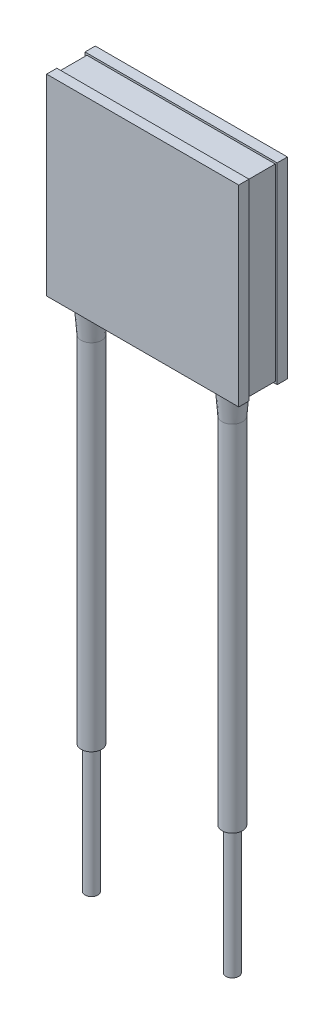
ISO-10303-21;
HEADER;
FILE_DESCRIPTION(('STEP AP214'),'2;1');
FILE_NAME('part.step','',(''),(''),'','','');
FILE_SCHEMA(('AUTOMOTIVE_DESIGN { 1 0 10303 214 1 1 1 1 }'));
ENDSEC;
DATA;
#1=APPLICATION_CONTEXT('core data for automotive mechanical design processes');
#2=APPLICATION_PROTOCOL_DEFINITION('international standard','automotive_design',2000,#1);
#3=PRODUCT_CONTEXT('',#1,'mechanical');
#4=PRODUCT('Part','Part','',(#3));
#5=PRODUCT_RELATED_PRODUCT_CATEGORY('part','',(#4));
#6=PRODUCT_DEFINITION_FORMATION('','',#4);
#7=PRODUCT_DEFINITION_CONTEXT('part definition',#1,'design');
#8=PRODUCT_DEFINITION('design','',#6,#7);
#9=PRODUCT_DEFINITION_SHAPE('','',#8);
#10=(LENGTH_UNIT() NAMED_UNIT(*) SI_UNIT(.MILLI.,.METRE.));
#11=(NAMED_UNIT(*) PLANE_ANGLE_UNIT() SI_UNIT($,.RADIAN.));
#12=(NAMED_UNIT(*) SI_UNIT($,.STERADIAN.) SOLID_ANGLE_UNIT());
#13=UNCERTAINTY_MEASURE_WITH_UNIT(LENGTH_MEASURE(1.E-05),#10,'distance_accuracy_value','');
#14=(GEOMETRIC_REPRESENTATION_CONTEXT(3) GLOBAL_UNCERTAINTY_ASSIGNED_CONTEXT((#13)) GLOBAL_UNIT_ASSIGNED_CONTEXT((#10,
#11,#12)) REPRESENTATION_CONTEXT('',''));
#15=CARTESIAN_POINT('',(0.,0.,0.));
#16=DIRECTION('',(0.,0.,1.));
#17=DIRECTION('',(1.,0.,0.));
#18=AXIS2_PLACEMENT_3D('',#15,#16,#17);
#19=CARTESIAN_POINT('',(5.5,-7.35,2.3));
#20=DIRECTION('',(0.,1.,0.));
#21=DIRECTION('',(1.,0.,0.));
#22=AXIS2_PLACEMENT_3D('',#19,#20,#21);
#23=CYLINDRICAL_SURFACE('',#22,0.5);
#24=CARTESIAN_POINT('',(5.5,-37.5,2.3));
#25=DIRECTION('',(0.,-1.,0.));
#26=DIRECTION('',(1.,0.,0.));
#27=AXIS2_PLACEMENT_3D('',#24,#25,#26);
#28=CIRCLE('',#27,0.5);
#29=CARTESIAN_POINT('',(6.,-37.5,2.3));
#30=VERTEX_POINT('',#29);
#31=EDGE_CURVE('E11',#30,#30,#28,.T.);
#32=ORIENTED_EDGE('',*,*,#31,.T.);
#33=EDGE_LOOP('',(#32));
#34=FACE_BOUND('',#33,.T.);
#35=CARTESIAN_POINT('',(5.5,-47.5,2.3));
#36=DIRECTION('',(0.,-1.,0.));
#37=DIRECTION('',(1.,0.,0.));
#38=AXIS2_PLACEMENT_3D('',#35,#36,#37);
#39=CIRCLE('',#38,0.5);
#40=CARTESIAN_POINT('',(6.,-47.5,2.3));
#41=VERTEX_POINT('',#40);
#42=EDGE_CURVE('E301',#41,#41,#39,.T.);
#43=ORIENTED_EDGE('',*,*,#42,.F.);
#44=EDGE_LOOP('',(#43));
#45=FACE_BOUND('',#44,.T.);
#46=ADVANCED_FACE('F16',(#34,#45),#23,.T.);
#47=CARTESIAN_POINT('',(5.5,-7.35,2.3));
#48=DIRECTION('',(0.,1.,0.));
#49=DIRECTION('',(1.,0.,0.));
#50=AXIS2_PLACEMENT_3D('',#47,#48,#49);
#51=CYLINDRICAL_SURFACE('',#50,0.8);
#52=CARTESIAN_POINT('',(5.5,-9.85,2.3));
#53=DIRECTION('',(0.,-1.,0.));
#54=DIRECTION('',(1.,0.,0.));
#55=AXIS2_PLACEMENT_3D('',#52,#53,#54);
#56=CIRCLE('',#55,0.8);
#57=CARTESIAN_POINT('',(6.3,-9.85,2.3));
#58=VERTEX_POINT('',#57);
#59=EDGE_CURVE('E26',#58,#58,#56,.T.);
#60=ORIENTED_EDGE('',*,*,#59,.T.);
#61=EDGE_LOOP('',(#60));
#62=FACE_BOUND('',#61,.T.);
#63=CARTESIAN_POINT('',(5.5,-37.5,2.3));
#64=DIRECTION('',(0.,-1.,0.));
#65=DIRECTION('',(1.,0.,0.));
#66=AXIS2_PLACEMENT_3D('',#63,#64,#65);
#67=CIRCLE('',#66,0.799999999999999);
#68=CARTESIAN_POINT('',(6.3,-37.5,2.3));
#69=VERTEX_POINT('',#68);
#70=EDGE_CURVE('E263',#69,#69,#67,.T.);
#71=ORIENTED_EDGE('',*,*,#70,.F.);
#72=EDGE_LOOP('',(#71));
#73=FACE_BOUND('',#72,.T.);
#74=ADVANCED_FACE('F308',(#62,#73),#51,.T.);
#75=CARTESIAN_POINT('',(5.5,-9.85,2.3));
#76=DIRECTION('',(0.,1.,0.));
#77=DIRECTION('',(1.,0.,0.));
#78=AXIS2_PLACEMENT_3D('',#75,#76,#77);
#79=CONICAL_SURFACE('',#78,0.8,0.0798299857122372);
#80=CARTESIAN_POINT('',(5.5,-7.35,2.3));
#81=DIRECTION('',(0.,-1.,0.));
#82=DIRECTION('',(0.,0.,1.));
#83=AXIS2_PLACEMENT_3D('',#80,#81,#82);
#84=CIRCLE('',#83,1.);
#85=CARTESIAN_POINT('',(4.78585715714572,-7.35,3.));
#86=VERTEX_POINT('',#85);
#87=CARTESIAN_POINT('',(6.21414284285429,-7.35,3.));
#88=VERTEX_POINT('',#87);
#89=EDGE_CURVE('E296',#86,#88,#84,.T.);
#90=ORIENTED_EDGE('',*,*,#89,.T.);
#91=CARTESIAN_POINT('',(6.21414284285429,-7.35,3.));
#92=CARTESIAN_POINT('',(6.20854131452161,-7.40000364209781,3.));
#93=CARTESIAN_POINT('',(6.20290787818541,-7.45000402656601,3.));
#94=CARTESIAN_POINT('',(6.19724027422403,-7.5,3.));
#95=B_SPLINE_CURVE_WITH_KNOTS('',3,(#91,#92,#93,#94),.UNSPECIFIED.,.F.,.F.,(4,4),
(0.00177126621246472,0.00192221302484469),.UNSPECIFIED.);
#96=CARTESIAN_POINT('',(6.19724027422403,-7.5,3.));
#97=VERTEX_POINT('',#96);
#98=EDGE_CURVE('E204',#88,#97,#95,.T.);
#99=ORIENTED_EDGE('',*,*,#98,.T.);
#100=CARTESIAN_POINT('',(5.5,-7.5,2.3));
#101=DIRECTION('',(0.,-1.,0.));
#102=DIRECTION('',(0.,0.,1.));
#103=AXIS2_PLACEMENT_3D('',#100,#101,#102);
#104=CIRCLE('',#103,0.988);
#105=CARTESIAN_POINT('',(4.80275972577597,-7.5,3.));
#106=VERTEX_POINT('',#105);
#107=EDGE_CURVE('E201',#97,#106,#104,.T.);
#108=ORIENTED_EDGE('',*,*,#107,.T.);
#109=CARTESIAN_POINT('',(4.80275972577597,-7.5,3.));
#110=CARTESIAN_POINT('',(4.79709209099586,-7.4500037547028,3.));
#111=CARTESIAN_POINT('',(4.79145867453783,-7.40000354443376,3.));
#112=CARTESIAN_POINT('',(4.78585715714572,-7.35,3.));
#113=B_SPLINE_CURVE_WITH_KNOTS('',3,(#109,#110,#111,#112),.UNSPECIFIED.,.F.,.F.,(4,4),
(0.00176171988814777,0.00191266054009144),.UNSPECIFIED.);
#114=EDGE_CURVE('E205',#106,#86,#113,.T.);
#115=ORIENTED_EDGE('',*,*,#114,.T.);
#116=EDGE_LOOP('',(#90,#99,#108,#115));
#117=FACE_BOUND('',#116,.T.);
#118=ORIENTED_EDGE('',*,*,#59,.F.);
#119=EDGE_LOOP('',(#118));
#120=FACE_BOUND('',#119,.T.);
#121=ADVANCED_FACE('F315',(#117,#120),#79,.T.);
#122=CARTESIAN_POINT('',(-5.5,-7.35,2.3));
#123=DIRECTION('',(0.,1.,0.));
#124=DIRECTION('',(-1.,0.,0.));
#125=AXIS2_PLACEMENT_3D('',#122,#123,#124);
#126=CYLINDRICAL_SURFACE('',#125,0.5);
#127=CARTESIAN_POINT('',(-5.5,-37.5,2.3));
#128=DIRECTION('',(0.,1.,0.));
#129=DIRECTION('',(-1.,0.,0.));
#130=AXIS2_PLACEMENT_3D('',#127,#128,#129);
#131=CIRCLE('',#130,0.5);
#132=CARTESIAN_POINT('',(-6.,-37.5,2.3));
#133=VERTEX_POINT('',#132);
#134=EDGE_CURVE('E251',#133,#133,#131,.T.);
#135=ORIENTED_EDGE('',*,*,#134,.F.);
#136=EDGE_LOOP('',(#135));
#137=FACE_BOUND('',#136,.T.);
#138=CARTESIAN_POINT('',(-5.5,-47.5,2.3));
#139=DIRECTION('',(0.,1.,0.));
#140=DIRECTION('',(-1.,0.,0.));
#141=AXIS2_PLACEMENT_3D('',#138,#139,#140);
#142=CIRCLE('',#141,0.5);
#143=CARTESIAN_POINT('',(-6.,-47.5,2.3));
#144=VERTEX_POINT('',#143);
#145=EDGE_CURVE('E291',#144,#144,#142,.T.);
#146=ORIENTED_EDGE('',*,*,#145,.T.);
#147=EDGE_LOOP('',(#146));
#148=FACE_BOUND('',#147,.T.);
#149=ADVANCED_FACE('F321',(#137,#148),#126,.T.);
#150=CARTESIAN_POINT('',(-5.5,-7.35,2.3));
#151=DIRECTION('',(0.,1.,0.));
#152=DIRECTION('',(-1.,0.,0.));
#153=AXIS2_PLACEMENT_3D('',#150,#151,#152);
#154=CYLINDRICAL_SURFACE('',#153,0.8);
#155=CARTESIAN_POINT('',(-5.5,-9.85,2.3));
#156=DIRECTION('',(0.,1.,0.));
#157=DIRECTION('',(-1.,0.,0.));
#158=AXIS2_PLACEMENT_3D('',#155,#156,#157);
#159=CIRCLE('',#158,0.8);
#160=CARTESIAN_POINT('',(-6.3,-9.85,2.3));
#161=VERTEX_POINT('',#160);
#162=EDGE_CURVE('E285',#161,#161,#159,.T.);
#163=ORIENTED_EDGE('',*,*,#162,.F.);
#164=EDGE_LOOP('',(#163));
#165=FACE_BOUND('',#164,.T.);
#166=CARTESIAN_POINT('',(-5.5,-37.5,2.3));
#167=DIRECTION('',(0.,1.,0.));
#168=DIRECTION('',(-1.,0.,0.));
#169=AXIS2_PLACEMENT_3D('',#166,#167,#168);
#170=CIRCLE('',#169,0.799999999999999);
#171=CARTESIAN_POINT('',(-6.3,-37.5,2.3));
#172=VERTEX_POINT('',#171);
#173=EDGE_CURVE('E288',#172,#172,#170,.T.);
#174=ORIENTED_EDGE('',*,*,#173,.T.);
#175=EDGE_LOOP('',(#174));
#176=FACE_BOUND('',#175,.T.);
#177=ADVANCED_FACE('F325',(#165,#176),#154,.T.);
#178=CARTESIAN_POINT('',(-5.5,-9.85,2.3));
#179=DIRECTION('',(0.,1.,0.));
#180=DIRECTION('',(-1.,0.,0.));
#181=AXIS2_PLACEMENT_3D('',#178,#179,#180);
#182=CONICAL_SURFACE('',#181,0.8,0.0798299857122372);
#183=CARTESIAN_POINT('',(-6.19724027422403,-7.5,3.));
#184=CARTESIAN_POINT('',(-6.20290790900415,-7.4500037547028,3.));
#185=CARTESIAN_POINT('',(-6.20854132546217,-7.40000354443376,3.));
#186=CARTESIAN_POINT('',(-6.21414284285429,-7.35,3.));
#187=B_SPLINE_CURVE_WITH_KNOTS('',3,(#183,#184,#185,#186),.UNSPECIFIED.,.F.,.F.,(4,4),
(0.00176171988814777,0.00191266054009144),.UNSPECIFIED.);
#188=CARTESIAN_POINT('',(-6.19724027422403,-7.5,3.));
#189=VERTEX_POINT('',#188);
#190=CARTESIAN_POINT('',(-6.21414284285429,-7.35,3.));
#191=VERTEX_POINT('',#190);
#192=EDGE_CURVE('E256',#189,#191,#187,.T.);
#193=ORIENTED_EDGE('',*,*,#192,.T.);
#194=CARTESIAN_POINT('',(-5.5,-7.35,2.3));
#195=DIRECTION('',(0.,-1.,0.));
#196=DIRECTION('',(0.,0.,1.));
#197=AXIS2_PLACEMENT_3D('',#194,#195,#196);
#198=CIRCLE('',#197,1.);
#199=CARTESIAN_POINT('',(-4.78585715714572,-7.35,3.));
#200=VERTEX_POINT('',#199);
#201=EDGE_CURVE('E280',#191,#200,#198,.T.);
#202=ORIENTED_EDGE('',*,*,#201,.T.);
#203=CARTESIAN_POINT('',(-4.78585715714572,-7.35,3.));
#204=CARTESIAN_POINT('',(-4.79145868547839,-7.40000364209781,3.));
#205=CARTESIAN_POINT('',(-4.7970921218146,-7.45000402656601,3.));
#206=CARTESIAN_POINT('',(-4.80275972577597,-7.5,3.));
#207=B_SPLINE_CURVE_WITH_KNOTS('',3,(#203,#204,#205,#206),.UNSPECIFIED.,.F.,.F.,(4,4),
(0.00177126621246472,0.00192221302484469),.UNSPECIFIED.);
#208=CARTESIAN_POINT('',(-4.80275972577597,-7.5,3.));
#209=VERTEX_POINT('',#208);
#210=EDGE_CURVE('E35',#200,#209,#207,.T.);
#211=ORIENTED_EDGE('',*,*,#210,.T.);
#212=CARTESIAN_POINT('',(-5.5,-7.5,2.3));
#213=DIRECTION('',(0.,-1.,0.));
#214=DIRECTION('',(0.,0.,1.));
#215=AXIS2_PLACEMENT_3D('',#212,#213,#214);
#216=CIRCLE('',#215,0.988);
#217=EDGE_CURVE('E271',#209,#189,#216,.T.);
#218=ORIENTED_EDGE('',*,*,#217,.T.);
#219=EDGE_LOOP('',(#193,#202,#211,#218));
#220=FACE_BOUND('',#219,.T.);
#221=ORIENTED_EDGE('',*,*,#162,.T.);
#222=EDGE_LOOP('',(#221));
#223=FACE_BOUND('',#222,.T.);
#224=ADVANCED_FACE('F329',(#220,#223),#182,.T.);
#225=CARTESIAN_POINT('',(-7.5,7.35,3.));
#226=DIRECTION('',(0.,0.,1.));
#227=DIRECTION('',(1.,0.,0.));
#228=AXIS2_PLACEMENT_3D('',#225,#226,#227);
#229=PLANE('',#228);
#230=ORIENTED_EDGE('',*,*,#114,.F.);
#231=DIRECTION('',(1.,0.,0.));
#232=VECTOR('',#231,1.);
#233=CARTESIAN_POINT('',(7.35,-7.5,3.));
#234=LINE('',#233,#232);
#235=EDGE_CURVE('E218',#209,#106,#234,.T.);
#236=ORIENTED_EDGE('',*,*,#235,.F.);
#237=ORIENTED_EDGE('',*,*,#210,.F.);
#238=DIRECTION('',(1.,0.,0.));
#239=VECTOR('',#238,1.);
#240=CARTESIAN_POINT('',(-7.5,-7.35,3.));
#241=LINE('',#240,#239);
#242=EDGE_CURVE('E247',#200,#86,#241,.T.);
#243=ORIENTED_EDGE('',*,*,#242,.T.);
#244=EDGE_LOOP('',(#230,#236,#237,#243));
#245=FACE_BOUND('',#244,.T.);
#246=ADVANCED_FACE('F333',(#245),#229,.F.);
#247=CARTESIAN_POINT('',(-7.5,7.35,3.));
#248=DIRECTION('',(0.,0.,1.));
#249=DIRECTION('',(1.,0.,0.));
#250=AXIS2_PLACEMENT_3D('',#247,#248,#249);
#251=PLANE('',#250);
#252=ORIENTED_EDGE('',*,*,#98,.F.);
#253=DIRECTION('',(1.,0.,0.));
#254=VECTOR('',#253,1.);
#255=CARTESIAN_POINT('',(-7.5,-7.35,3.));
#256=LINE('',#255,#254);
#257=CARTESIAN_POINT('',(7.35,-7.35,3.));
#258=VERTEX_POINT('',#257);
#259=EDGE_CURVE('E243',#88,#258,#256,.T.);
#260=ORIENTED_EDGE('',*,*,#259,.T.);
#261=DIRECTION('',(0.,-1.,0.));
#262=VECTOR('',#261,1.);
#263=CARTESIAN_POINT('',(7.35,-7.5,3.));
#264=LINE('',#263,#262);
#265=CARTESIAN_POINT('',(7.35,7.35,3.));
#266=VERTEX_POINT('',#265);
#267=EDGE_CURVE('E152',#266,#258,#264,.T.);
#268=ORIENTED_EDGE('',*,*,#267,.F.);
#269=DIRECTION('',(1.,0.,0.));
#270=VECTOR('',#269,1.);
#271=CARTESIAN_POINT('',(-7.5,7.35,3.));
#272=LINE('',#271,#270);
#273=CARTESIAN_POINT('',(-7.35,7.35,3.));
#274=VERTEX_POINT('',#273);
#275=EDGE_CURVE('E158',#274,#266,#272,.T.);
#276=ORIENTED_EDGE('',*,*,#275,.F.);
#277=DIRECTION('',(0.,-1.,0.));
#278=VECTOR('',#277,1.);
#279=CARTESIAN_POINT('',(-7.35,-7.5,3.));
#280=LINE('',#279,#278);
#281=CARTESIAN_POINT('',(-7.35,-7.35,3.));
#282=VERTEX_POINT('',#281);
#283=EDGE_CURVE('E240',#274,#282,#280,.T.);
#284=ORIENTED_EDGE('',*,*,#283,.T.);
#285=DIRECTION('',(1.,0.,0.));
#286=VECTOR('',#285,1.);
#287=CARTESIAN_POINT('',(-7.5,-7.35,3.));
#288=LINE('',#287,#286);
#289=EDGE_CURVE('E235',#282,#191,#288,.T.);
#290=ORIENTED_EDGE('',*,*,#289,.T.);
#291=ORIENTED_EDGE('',*,*,#192,.F.);
#292=DIRECTION('',(1.,0.,0.));
#293=VECTOR('',#292,1.);
#294=CARTESIAN_POINT('',(7.35,-7.5,3.));
#295=LINE('',#294,#293);
#296=CARTESIAN_POINT('',(-7.5,-7.5,3.));
#297=VERTEX_POINT('',#296);
#298=EDGE_CURVE('E226',#297,#189,#295,.T.);
#299=ORIENTED_EDGE('',*,*,#298,.F.);
#300=DIRECTION('',(0.,1.,0.));
#301=VECTOR('',#300,1.);
#302=CARTESIAN_POINT('',(-7.5,7.35,3.));
#303=LINE('',#302,#301);
#304=CARTESIAN_POINT('',(-7.5,7.5,3.));
#305=VERTEX_POINT('',#304);
#306=EDGE_CURVE('E232',#297,#305,#303,.T.);
#307=ORIENTED_EDGE('',*,*,#306,.T.);
#308=DIRECTION('',(1.,0.,0.));
#309=VECTOR('',#308,1.);
#310=CARTESIAN_POINT('',(-7.5,7.5,3.));
#311=LINE('',#310,#309);
#312=CARTESIAN_POINT('',(7.5,7.5,3.));
#313=VERTEX_POINT('',#312);
#314=EDGE_CURVE('E221',#305,#313,#311,.T.);
#315=ORIENTED_EDGE('',*,*,#314,.T.);
#316=DIRECTION('',(0.,1.,0.));
#317=VECTOR('',#316,1.);
#318=CARTESIAN_POINT('',(7.5,7.35,3.));
#319=LINE('',#318,#317);
#320=CARTESIAN_POINT('',(7.5,-7.5,3.));
#321=VERTEX_POINT('',#320);
#322=EDGE_CURVE('E185',#321,#313,#319,.T.);
#323=ORIENTED_EDGE('',*,*,#322,.F.);
#324=DIRECTION('',(1.,0.,0.));
#325=VECTOR('',#324,1.);
#326=CARTESIAN_POINT('',(7.35,-7.5,3.));
#327=LINE('',#326,#325);
#328=EDGE_CURVE('E210',#97,#321,#327,.T.);
#329=ORIENTED_EDGE('',*,*,#328,.F.);
#330=EDGE_LOOP('',(#252,#260,#268,#276,#284,#290,#291,#299,#307,#315,#323,#329));
#331=FACE_BOUND('',#330,.T.);
#332=ADVANCED_FACE('F337',(#331),#251,.F.);
#333=CARTESIAN_POINT('',(-7.5,7.5,3.8));
#334=DIRECTION('',(1.,0.,0.));
#335=DIRECTION('',(0.,1.,0.));
#336=AXIS2_PLACEMENT_3D('',#333,#334,#335);
#337=PLANE('',#336);
#338=ORIENTED_EDGE('',*,*,#306,.F.);
#339=DIRECTION('',(0.,0.,-1.));
#340=VECTOR('',#339,1.);
#341=CARTESIAN_POINT('',(-7.5,-7.5,3.8));
#342=LINE('',#341,#340);
#343=CARTESIAN_POINT('',(-7.5,-7.5,3.8));
#344=VERTEX_POINT('',#343);
#345=EDGE_CURVE('E223',#344,#297,#342,.T.);
#346=ORIENTED_EDGE('',*,*,#345,.F.);
#347=DIRECTION('',(0.,-1.,0.));
#348=VECTOR('',#347,1.);
#349=CARTESIAN_POINT('',(-7.5,7.5,3.8));
#350=LINE('',#349,#348);
#351=CARTESIAN_POINT('',(-7.5,7.5,3.8));
#352=VERTEX_POINT('',#351);
#353=EDGE_CURVE('E170',#352,#344,#350,.T.);
#354=ORIENTED_EDGE('',*,*,#353,.F.);
#355=DIRECTION('',(0.,0.,-1.));
#356=VECTOR('',#355,1.);
#357=CARTESIAN_POINT('',(-7.5,7.5,3.8));
#358=LINE('',#357,#356);
#359=EDGE_CURVE('E216',#352,#305,#358,.T.);
#360=ORIENTED_EDGE('',*,*,#359,.T.);
#361=EDGE_LOOP('',(#338,#346,#354,#360));
#362=FACE_BOUND('',#361,.T.);
#363=ADVANCED_FACE('F340',(#362),#337,.F.);
#364=CARTESIAN_POINT('',(-7.5,7.5,3.8));
#365=DIRECTION('',(1.,0.,0.));
#366=DIRECTION('',(0.,1.,0.));
#367=AXIS2_PLACEMENT_3D('',#364,#365,#366);
#368=PLANE('',#367);
#369=DIRECTION('',(0.,0.,-1.));
#370=VECTOR('',#369,1.);
#371=CARTESIAN_POINT('',(-7.5,-7.5,3.8));
#372=LINE('',#371,#370);
#373=CARTESIAN_POINT('',(-7.5,-7.5,0.8));
#374=VERTEX_POINT('',#373);
#375=CARTESIAN_POINT('',(-7.5,-7.5,0.));
#376=VERTEX_POINT('',#375);
#377=EDGE_CURVE('E195',#374,#376,#372,.T.);
#378=ORIENTED_EDGE('',*,*,#377,.F.);
#379=DIRECTION('',(0.,1.,0.));
#380=VECTOR('',#379,1.);
#381=CARTESIAN_POINT('',(-7.5,7.35,0.8));
#382=LINE('',#381,#380);
#383=CARTESIAN_POINT('',(-7.5,7.5,0.8));
#384=VERTEX_POINT('',#383);
#385=EDGE_CURVE('E213',#374,#384,#382,.T.);
#386=ORIENTED_EDGE('',*,*,#385,.T.);
#387=DIRECTION('',(0.,0.,-1.));
#388=VECTOR('',#387,1.);
#389=CARTESIAN_POINT('',(-7.5,7.5,3.8));
#390=LINE('',#389,#388);
#391=CARTESIAN_POINT('',(-7.5,7.5,0.));
#392=VERTEX_POINT('',#391);
#393=EDGE_CURVE('E209',#384,#392,#390,.T.);
#394=ORIENTED_EDGE('',*,*,#393,.T.);
#395=DIRECTION('',(0.,-1.,0.));
#396=VECTOR('',#395,1.);
#397=CARTESIAN_POINT('',(-7.5,7.5,0.));
#398=LINE('',#397,#396);
#399=EDGE_CURVE('E206',#392,#376,#398,.T.);
#400=ORIENTED_EDGE('',*,*,#399,.T.);
#401=EDGE_LOOP('',(#378,#386,#394,#400));
#402=FACE_BOUND('',#401,.T.);
#403=ADVANCED_FACE('F344',(#402),#368,.F.);
#404=CARTESIAN_POINT('',(-7.5,-7.5,3.8));
#405=DIRECTION('',(0.,1.,0.));
#406=DIRECTION('',(0.,0.,1.));
#407=AXIS2_PLACEMENT_3D('',#404,#405,#406);
#408=PLANE('',#407);
#409=ORIENTED_EDGE('',*,*,#107,.F.);
#410=ORIENTED_EDGE('',*,*,#328,.T.);
#411=DIRECTION('',(0.,0.,-1.));
#412=VECTOR('',#411,1.);
#413=CARTESIAN_POINT('',(7.5,-7.5,3.8));
#414=LINE('',#413,#412);
#415=CARTESIAN_POINT('',(7.5,-7.5,3.8));
#416=VERTEX_POINT('',#415);
#417=EDGE_CURVE('E196',#416,#321,#414,.T.);
#418=ORIENTED_EDGE('',*,*,#417,.F.);
#419=DIRECTION('',(1.,0.,0.));
#420=VECTOR('',#419,1.);
#421=CARTESIAN_POINT('',(-7.5,-7.5,3.8));
#422=LINE('',#421,#420);
#423=EDGE_CURVE('E165',#344,#416,#422,.T.);
#424=ORIENTED_EDGE('',*,*,#423,.F.);
#425=ORIENTED_EDGE('',*,*,#345,.T.);
#426=ORIENTED_EDGE('',*,*,#298,.T.);
#427=ORIENTED_EDGE('',*,*,#217,.F.);
#428=ORIENTED_EDGE('',*,*,#235,.T.);
#429=EDGE_LOOP('',(#409,#410,#418,#424,#425,#426,#427,#428));
#430=FACE_BOUND('',#429,.T.);
#431=ADVANCED_FACE('F348',(#430),#408,.F.);
#432=CARTESIAN_POINT('',(-7.5,-7.5,3.8));
#433=DIRECTION('',(0.,1.,0.));
#434=DIRECTION('',(0.,0.,1.));
#435=AXIS2_PLACEMENT_3D('',#432,#433,#434);
#436=PLANE('',#435);
#437=DIRECTION('',(1.,0.,0.));
#438=VECTOR('',#437,1.);
#439=CARTESIAN_POINT('',(7.35,-7.5,0.8));
#440=LINE('',#439,#438);
#441=CARTESIAN_POINT('',(7.5,-7.5,0.8));
#442=VERTEX_POINT('',#441);
#443=EDGE_CURVE('E178',#374,#442,#440,.T.);
#444=ORIENTED_EDGE('',*,*,#443,.F.);
#445=ORIENTED_EDGE('',*,*,#377,.T.);
#446=DIRECTION('',(1.,0.,0.));
#447=VECTOR('',#446,1.);
#448=CARTESIAN_POINT('',(-7.5,-7.5,0.));
#449=LINE('',#448,#447);
#450=CARTESIAN_POINT('',(7.5,-7.5,0.));
#451=VERTEX_POINT('',#450);
#452=EDGE_CURVE('E192',#376,#451,#449,.T.);
#453=ORIENTED_EDGE('',*,*,#452,.T.);
#454=DIRECTION('',(0.,0.,-1.));
#455=VECTOR('',#454,1.);
#456=CARTESIAN_POINT('',(7.5,-7.5,3.8));
#457=LINE('',#456,#455);
#458=EDGE_CURVE('E174',#442,#451,#457,.T.);
#459=ORIENTED_EDGE('',*,*,#458,.F.);
#460=EDGE_LOOP('',(#444,#445,#453,#459));
#461=FACE_BOUND('',#460,.T.);
#462=ADVANCED_FACE('F352',(#461),#436,.F.);
#463=CARTESIAN_POINT('',(7.5,7.5,3.8));
#464=DIRECTION('',(-1.,0.,0.));
#465=DIRECTION('',(0.,-1.,0.));
#466=AXIS2_PLACEMENT_3D('',#463,#464,#465);
#467=PLANE('',#466);
#468=ORIENTED_EDGE('',*,*,#417,.T.);
#469=ORIENTED_EDGE('',*,*,#322,.T.);
#470=DIRECTION('',(0.,0.,-1.));
#471=VECTOR('',#470,1.);
#472=CARTESIAN_POINT('',(7.5,7.5,3.8));
#473=LINE('',#472,#471);
#474=CARTESIAN_POINT('',(7.5,7.5,3.8));
#475=VERTEX_POINT('',#474);
#476=EDGE_CURVE('E175',#475,#313,#473,.T.);
#477=ORIENTED_EDGE('',*,*,#476,.F.);
#478=DIRECTION('',(0.,1.,0.));
#479=VECTOR('',#478,1.);
#480=CARTESIAN_POINT('',(7.5,7.5,3.8));
#481=LINE('',#480,#479);
#482=EDGE_CURVE('E169',#416,#475,#481,.T.);
#483=ORIENTED_EDGE('',*,*,#482,.F.);
#484=EDGE_LOOP('',(#468,#469,#477,#483));
#485=FACE_BOUND('',#484,.T.);
#486=ADVANCED_FACE('F356',(#485),#467,.F.);
#487=CARTESIAN_POINT('',(-7.5,7.5,3.8));
#488=DIRECTION('',(0.,-1.,0.));
#489=DIRECTION('',(0.,0.,-1.));
#490=AXIS2_PLACEMENT_3D('',#487,#488,#489);
#491=PLANE('',#490);
#492=ORIENTED_EDGE('',*,*,#393,.F.);
#493=DIRECTION('',(-1.,0.,0.));
#494=VECTOR('',#493,1.);
#495=CARTESIAN_POINT('',(-7.5,7.5,0.8));
#496=LINE('',#495,#494);
#497=CARTESIAN_POINT('',(7.5,7.5,0.8));
#498=VERTEX_POINT('',#497);
#499=EDGE_CURVE('E149',#498,#384,#496,.T.);
#500=ORIENTED_EDGE('',*,*,#499,.F.);
#501=DIRECTION('',(0.,0.,-1.));
#502=VECTOR('',#501,1.);
#503=CARTESIAN_POINT('',(7.5,7.5,3.8));
#504=LINE('',#503,#502);
#505=CARTESIAN_POINT('',(7.5,7.5,0.));
#506=VERTEX_POINT('',#505);
#507=EDGE_CURVE('E182',#498,#506,#504,.T.);
#508=ORIENTED_EDGE('',*,*,#507,.T.);
#509=DIRECTION('',(-1.,0.,0.));
#510=VECTOR('',#509,1.);
#511=CARTESIAN_POINT('',(-7.5,7.5,0.));
#512=LINE('',#511,#510);
#513=EDGE_CURVE('E179',#506,#392,#512,.T.);
#514=ORIENTED_EDGE('',*,*,#513,.T.);
#515=EDGE_LOOP('',(#492,#500,#508,#514));
#516=FACE_BOUND('',#515,.T.);
#517=ADVANCED_FACE('F360',(#516),#491,.F.);
#518=CARTESIAN_POINT('',(7.5,7.5,3.8));
#519=DIRECTION('',(-1.,0.,0.));
#520=DIRECTION('',(0.,-1.,0.));
#521=AXIS2_PLACEMENT_3D('',#518,#519,#520);
#522=PLANE('',#521);
#523=DIRECTION('',(0.,1.,0.));
#524=VECTOR('',#523,1.);
#525=CARTESIAN_POINT('',(7.5,7.35,0.8));
#526=LINE('',#525,#524);
#527=EDGE_CURVE('E163',#442,#498,#526,.T.);
#528=ORIENTED_EDGE('',*,*,#527,.F.);
#529=ORIENTED_EDGE('',*,*,#458,.T.);
#530=DIRECTION('',(0.,1.,0.));
#531=VECTOR('',#530,1.);
#532=CARTESIAN_POINT('',(7.5,7.5,0.));
#533=LINE('',#532,#531);
#534=EDGE_CURVE('E171',#451,#506,#533,.T.);
#535=ORIENTED_EDGE('',*,*,#534,.T.);
#536=ORIENTED_EDGE('',*,*,#507,.F.);
#537=EDGE_LOOP('',(#528,#529,#535,#536));
#538=FACE_BOUND('',#537,.T.);
#539=ADVANCED_FACE('F364',(#538),#522,.F.);
#540=CARTESIAN_POINT('',(-7.5,7.5,3.8));
#541=DIRECTION('',(0.,-1.,0.));
#542=DIRECTION('',(0.,0.,-1.));
#543=AXIS2_PLACEMENT_3D('',#540,#541,#542);
#544=PLANE('',#543);
#545=ORIENTED_EDGE('',*,*,#476,.T.);
#546=ORIENTED_EDGE('',*,*,#314,.F.);
#547=ORIENTED_EDGE('',*,*,#359,.F.);
#548=DIRECTION('',(-1.,0.,0.));
#549=VECTOR('',#548,1.);
#550=CARTESIAN_POINT('',(-7.5,7.5,3.8));
#551=LINE('',#550,#549);
#552=EDGE_CURVE('E166',#475,#352,#551,.T.);
#553=ORIENTED_EDGE('',*,*,#552,.F.);
#554=EDGE_LOOP('',(#545,#546,#547,#553));
#555=FACE_BOUND('',#554,.T.);
#556=ADVANCED_FACE('F368',(#555),#544,.F.);
#557=CARTESIAN_POINT('',(0.,0.,3.8));
#558=DIRECTION('',(0.,0.,1.));
#559=DIRECTION('',(1.,0.,0.));
#560=AXIS2_PLACEMENT_3D('',#557,#558,#559);
#561=PLANE('',#560);
#562=ORIENTED_EDGE('',*,*,#482,.T.);
#563=ORIENTED_EDGE('',*,*,#552,.T.);
#564=ORIENTED_EDGE('',*,*,#353,.T.);
#565=ORIENTED_EDGE('',*,*,#423,.T.);
#566=EDGE_LOOP('',(#562,#563,#564,#565));
#567=FACE_BOUND('',#566,.T.);
#568=ADVANCED_FACE('F372',(#567),#561,.T.);
#569=CARTESIAN_POINT('',(0.,0.,0.));
#570=DIRECTION('',(0.,0.,1.));
#571=DIRECTION('',(1.,0.,0.));
#572=AXIS2_PLACEMENT_3D('',#569,#570,#571);
#573=PLANE('',#572);
#574=ORIENTED_EDGE('',*,*,#534,.F.);
#575=ORIENTED_EDGE('',*,*,#452,.F.);
#576=ORIENTED_EDGE('',*,*,#399,.F.);
#577=ORIENTED_EDGE('',*,*,#513,.F.);
#578=EDGE_LOOP('',(#574,#575,#576,#577));
#579=FACE_BOUND('',#578,.T.);
#580=ADVANCED_FACE('F376',(#579),#573,.F.);
#581=CARTESIAN_POINT('',(-7.5,7.35,0.8));
#582=DIRECTION('',(0.,0.,-1.));
#583=DIRECTION('',(-1.,0.,0.));
#584=AXIS2_PLACEMENT_3D('',#581,#582,#583);
#585=PLANE('',#584);
#586=DIRECTION('',(0.,1.,0.));
#587=VECTOR('',#586,1.);
#588=CARTESIAN_POINT('',(-7.35,-7.5,0.8));
#589=LINE('',#588,#587);
#590=CARTESIAN_POINT('',(-7.35,-7.35,0.8));
#591=VERTEX_POINT('',#590);
#592=CARTESIAN_POINT('',(-7.35,7.35,0.8));
#593=VERTEX_POINT('',#592);
#594=EDGE_CURVE('E148',#591,#593,#589,.T.);
#595=ORIENTED_EDGE('',*,*,#594,.T.);
#596=DIRECTION('',(-1.,0.,0.));
#597=VECTOR('',#596,1.);
#598=CARTESIAN_POINT('',(-7.5,7.35,0.8));
#599=LINE('',#598,#597);
#600=CARTESIAN_POINT('',(7.35,7.35,0.8));
#601=VERTEX_POINT('',#600);
#602=EDGE_CURVE('E138',#601,#593,#599,.T.);
#603=ORIENTED_EDGE('',*,*,#602,.F.);
#604=DIRECTION('',(0.,1.,0.));
#605=VECTOR('',#604,1.);
#606=CARTESIAN_POINT('',(7.35,-7.5,0.8));
#607=LINE('',#606,#605);
#608=CARTESIAN_POINT('',(7.35,-7.35,0.8));
#609=VERTEX_POINT('',#608);
#610=EDGE_CURVE('E129',#609,#601,#607,.T.);
#611=ORIENTED_EDGE('',*,*,#610,.F.);
#612=DIRECTION('',(-1.,0.,0.));
#613=VECTOR('',#612,1.);
#614=CARTESIAN_POINT('',(-7.5,-7.35,0.8));
#615=LINE('',#614,#613);
#616=EDGE_CURVE('E136',#609,#591,#615,.T.);
#617=ORIENTED_EDGE('',*,*,#616,.T.);
#618=EDGE_LOOP('',(#595,#603,#611,#617));
#619=FACE_BOUND('',#618,.T.);
#620=ORIENTED_EDGE('',*,*,#499,.T.);
#621=ORIENTED_EDGE('',*,*,#385,.F.);
#622=ORIENTED_EDGE('',*,*,#443,.T.);
#623=ORIENTED_EDGE('',*,*,#527,.T.);
#624=EDGE_LOOP('',(#620,#621,#622,#623));
#625=FACE_BOUND('',#624,.T.);
#626=ADVANCED_FACE('F134',(#619,#625),#585,.F.);
#627=CARTESIAN_POINT('',(0.,7.35,0.));
#628=DIRECTION('',(0.,-1.,0.));
#629=DIRECTION('',(0.,0.,-1.));
#630=AXIS2_PLACEMENT_3D('',#627,#628,#629);
#631=PLANE('',#630);
#632=ORIENTED_EDGE('',*,*,#602,.T.);
#633=DIRECTION('',(0.,0.,1.));
#634=VECTOR('',#633,1.);
#635=CARTESIAN_POINT('',(-7.35,7.35,0.));
#636=LINE('',#635,#634);
#637=EDGE_CURVE('E159',#593,#274,#636,.T.);
#638=ORIENTED_EDGE('',*,*,#637,.T.);
#639=ORIENTED_EDGE('',*,*,#275,.T.);
#640=DIRECTION('',(0.,0.,-1.));
#641=VECTOR('',#640,1.);
#642=CARTESIAN_POINT('',(7.35,7.35,0.));
#643=LINE('',#642,#641);
#644=EDGE_CURVE('E154',#266,#601,#643,.T.);
#645=ORIENTED_EDGE('',*,*,#644,.T.);
#646=EDGE_LOOP('',(#632,#638,#639,#645));
#647=FACE_BOUND('',#646,.T.);
#648=ADVANCED_FACE('F383',(#647),#631,.F.);
#649=CARTESIAN_POINT('',(7.35,0.,0.));
#650=DIRECTION('',(-1.,0.,0.));
#651=DIRECTION('',(0.,-1.,0.));
#652=AXIS2_PLACEMENT_3D('',#649,#650,#651);
#653=PLANE('',#652);
#654=ORIENTED_EDGE('',*,*,#267,.T.);
#655=DIRECTION('',(0.,0.,-1.));
#656=VECTOR('',#655,1.);
#657=CARTESIAN_POINT('',(7.35,-7.35,0.));
#658=LINE('',#657,#656);
#659=EDGE_CURVE('E140',#258,#609,#658,.T.);
#660=ORIENTED_EDGE('',*,*,#659,.T.);
#661=ORIENTED_EDGE('',*,*,#610,.T.);
#662=ORIENTED_EDGE('',*,*,#644,.F.);
#663=EDGE_LOOP('',(#654,#660,#661,#662));
#664=FACE_BOUND('',#663,.T.);
#665=ADVANCED_FACE('F151',(#664),#653,.F.);
#666=CARTESIAN_POINT('',(0.,-7.35,0.));
#667=DIRECTION('',(0.,1.,0.));
#668=DIRECTION('',(0.,0.,-1.));
#669=AXIS2_PLACEMENT_3D('',#666,#667,#668);
#670=PLANE('',#669);
#671=ORIENTED_EDGE('',*,*,#89,.F.);
#672=ORIENTED_EDGE('',*,*,#242,.F.);
#673=ORIENTED_EDGE('',*,*,#201,.F.);
#674=ORIENTED_EDGE('',*,*,#289,.F.);
#675=DIRECTION('',(0.,0.,-1.));
#676=VECTOR('',#675,1.);
#677=CARTESIAN_POINT('',(-7.35,-7.35,0.));
#678=LINE('',#677,#676);
#679=EDGE_CURVE('E20',#282,#591,#678,.T.);
#680=ORIENTED_EDGE('',*,*,#679,.T.);
#681=ORIENTED_EDGE('',*,*,#616,.F.);
#682=ORIENTED_EDGE('',*,*,#659,.F.);
#683=ORIENTED_EDGE('',*,*,#259,.F.);
#684=EDGE_LOOP('',(#671,#672,#673,#674,#680,#681,#682,#683));
#685=FACE_BOUND('',#684,.T.);
#686=ADVANCED_FACE('F145',(#685),#670,.F.);
#687=CARTESIAN_POINT('',(-7.35,0.,0.));
#688=DIRECTION('',(1.,0.,0.));
#689=DIRECTION('',(0.,-1.,0.));
#690=AXIS2_PLACEMENT_3D('',#687,#688,#689);
#691=PLANE('',#690);
#692=ORIENTED_EDGE('',*,*,#594,.F.);
#693=ORIENTED_EDGE('',*,*,#679,.F.);
#694=ORIENTED_EDGE('',*,*,#283,.F.);
#695=ORIENTED_EDGE('',*,*,#637,.F.);
#696=EDGE_LOOP('',(#692,#693,#694,#695));
#697=FACE_BOUND('',#696,.T.);
#698=ADVANCED_FACE('F391',(#697),#691,.F.);
#699=CARTESIAN_POINT('',(-4.7,-37.5,2.3));
#700=DIRECTION('',(0.,1.,0.));
#701=DIRECTION('',(-1.,0.,0.));
#702=AXIS2_PLACEMENT_3D('',#699,#700,#701);
#703=PLANE('',#702);
#704=ORIENTED_EDGE('',*,*,#173,.F.);
#705=EDGE_LOOP('',(#704));
#706=FACE_BOUND('',#705,.T.);
#707=ORIENTED_EDGE('',*,*,#134,.T.);
#708=EDGE_LOOP('',(#707));
#709=FACE_BOUND('',#708,.T.);
#710=ADVANCED_FACE('F394',(#706,#709),#703,.F.);
#711=CARTESIAN_POINT('',(-5.,-47.5,2.3));
#712=DIRECTION('',(0.,1.,0.));
#713=DIRECTION('',(-1.,0.,0.));
#714=AXIS2_PLACEMENT_3D('',#711,#712,#713);
#715=PLANE('',#714);
#716=ORIENTED_EDGE('',*,*,#145,.F.);
#717=EDGE_LOOP('',(#716));
#718=FACE_BOUND('',#717,.T.);
#719=ADVANCED_FACE('F398',(#718),#715,.F.);
#720=CARTESIAN_POINT('',(4.7,-37.5,2.3));
#721=DIRECTION('',(0.,1.,0.));
#722=DIRECTION('',(1.,0.,0.));
#723=AXIS2_PLACEMENT_3D('',#720,#721,#722);
#724=PLANE('',#723);
#725=ORIENTED_EDGE('',*,*,#70,.T.);
#726=EDGE_LOOP('',(#725));
#727=FACE_BOUND('',#726,.T.);
#728=ORIENTED_EDGE('',*,*,#31,.F.);
#729=EDGE_LOOP('',(#728));
#730=FACE_BOUND('',#729,.T.);
#731=ADVANCED_FACE('F401',(#727,#730),#724,.F.);
#732=CARTESIAN_POINT('',(5.,-47.5,2.3));
#733=DIRECTION('',(0.,1.,0.));
#734=DIRECTION('',(1.,0.,0.));
#735=AXIS2_PLACEMENT_3D('',#732,#733,#734);
#736=PLANE('',#735);
#737=ORIENTED_EDGE('',*,*,#42,.T.);
#738=EDGE_LOOP('',(#737));
#739=FACE_BOUND('',#738,.T.);
#740=ADVANCED_FACE('F18',(#739),#736,.F.);
#741=CLOSED_SHELL('',(#46,#74,#121,#149,#177,#224,#246,#332,#363,#403,#431,#462,#486,#517,#539,
#556,#568,#580,#626,#648,#665,#686,#698,#710,#719,#731,#740));
#742=MANIFOLD_SOLID_BREP('B1',#741);
#743=ADVANCED_BREP_SHAPE_REPRESENTATION('',(#18,#742),#14);
#744=SHAPE_DEFINITION_REPRESENTATION(#9,#743);
ENDSEC;
END-ISO-10303-21;
